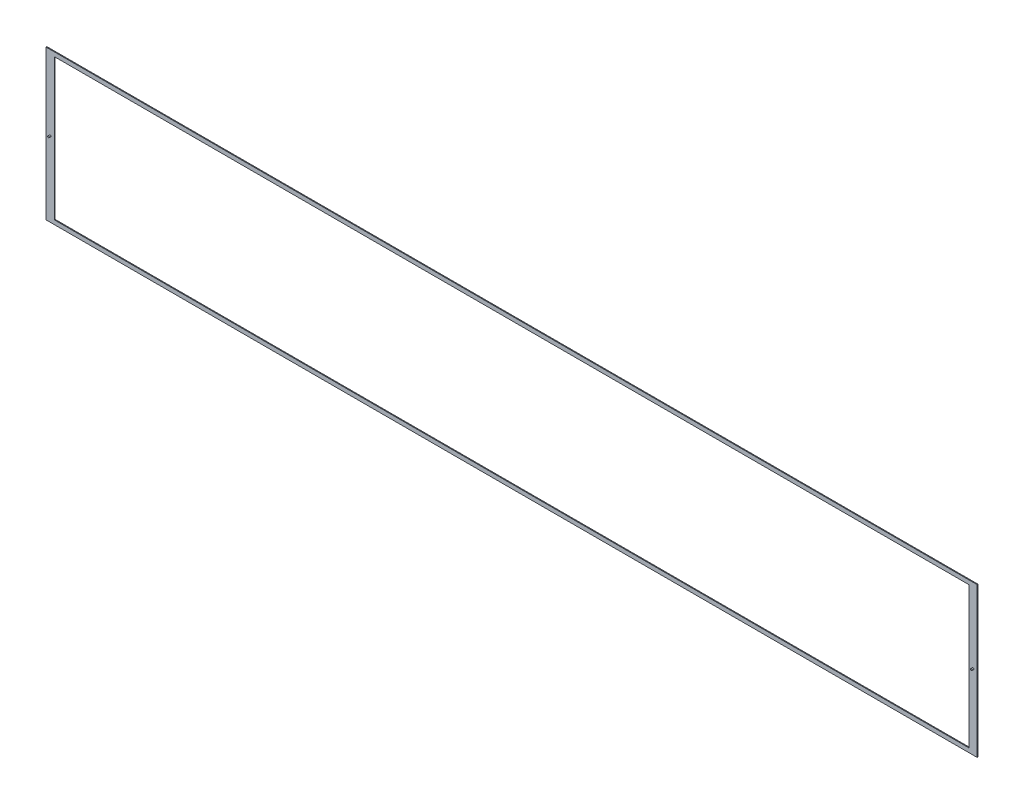
ISO-10303-21;
HEADER;
FILE_DESCRIPTION(('STEP AP214'),'2;1');
FILE_NAME('part.step','',(''),(''),'','','');
FILE_SCHEMA(('AUTOMOTIVE_DESIGN { 1 0 10303 214 1 1 1 1 }'));
ENDSEC;
DATA;
#1=APPLICATION_CONTEXT('core data for automotive mechanical design processes');
#2=APPLICATION_PROTOCOL_DEFINITION('international standard','automotive_design',2000,#1);
#3=PRODUCT_CONTEXT('',#1,'mechanical');
#4=PRODUCT('Part','Part','',(#3));
#5=PRODUCT_RELATED_PRODUCT_CATEGORY('part','',(#4));
#6=PRODUCT_DEFINITION_FORMATION('','',#4);
#7=PRODUCT_DEFINITION_CONTEXT('part definition',#1,'design');
#8=PRODUCT_DEFINITION('design','',#6,#7);
#9=PRODUCT_DEFINITION_SHAPE('','',#8);
#10=(LENGTH_UNIT() NAMED_UNIT(*) SI_UNIT(.MILLI.,.METRE.));
#11=(NAMED_UNIT(*) PLANE_ANGLE_UNIT() SI_UNIT($,.RADIAN.));
#12=(NAMED_UNIT(*) SI_UNIT($,.STERADIAN.) SOLID_ANGLE_UNIT());
#13=UNCERTAINTY_MEASURE_WITH_UNIT(LENGTH_MEASURE(1.E-05),#10,'distance_accuracy_value','');
#14=(GEOMETRIC_REPRESENTATION_CONTEXT(3) GLOBAL_UNCERTAINTY_ASSIGNED_CONTEXT((#13)) GLOBAL_UNIT_ASSIGNED_CONTEXT((#10,
#11,#12)) REPRESENTATION_CONTEXT('',''));
#15=CARTESIAN_POINT('',(0.,0.,0.));
#16=DIRECTION('',(0.,0.,1.));
#17=DIRECTION('',(1.,0.,0.));
#18=AXIS2_PLACEMENT_3D('',#15,#16,#17);
#19=CARTESIAN_POINT('',(-560.,-90.,1.));
#20=DIRECTION('',(-1.,0.,0.));
#21=DIRECTION('',(0.,0.,1.));
#22=AXIS2_PLACEMENT_3D('',#19,#20,#21);
#23=PLANE('',#22);
#24=DIRECTION('',(0.,1.,0.));
#25=VECTOR('',#24,1.);
#26=CARTESIAN_POINT('',(-560.,-90.,0.));
#27=LINE('',#26,#25);
#28=CARTESIAN_POINT('',(-560.,-90.,0.));
#29=VERTEX_POINT('',#28);
#30=CARTESIAN_POINT('',(-560.,90.,0.));
#31=VERTEX_POINT('',#30);
#32=EDGE_CURVE('E172',#29,#31,#27,.T.);
#33=ORIENTED_EDGE('',*,*,#32,.F.);
#34=DIRECTION('',(0.,0.,-1.));
#35=VECTOR('',#34,1.);
#36=CARTESIAN_POINT('',(-560.,-90.,1.));
#37=LINE('',#36,#35);
#38=CARTESIAN_POINT('',(-560.,-90.,1.));
#39=VERTEX_POINT('',#38);
#40=EDGE_CURVE('E71',#39,#29,#37,.T.);
#41=ORIENTED_EDGE('',*,*,#40,.F.);
#42=DIRECTION('',(0.,1.,0.));
#43=VECTOR('',#42,1.);
#44=CARTESIAN_POINT('',(-560.,-90.,1.));
#45=LINE('',#44,#43);
#46=CARTESIAN_POINT('',(-560.,90.,1.));
#47=VERTEX_POINT('',#46);
#48=EDGE_CURVE('E178',#39,#47,#45,.T.);
#49=ORIENTED_EDGE('',*,*,#48,.T.);
#50=DIRECTION('',(0.,0.,-1.));
#51=VECTOR('',#50,1.);
#52=CARTESIAN_POINT('',(-560.,90.,1.));
#53=LINE('',#52,#51);
#54=EDGE_CURVE('E193',#47,#31,#53,.T.);
#55=ORIENTED_EDGE('',*,*,#54,.T.);
#56=EDGE_LOOP('',(#33,#41,#49,#55));
#57=FACE_BOUND('',#56,.T.);
#58=ADVANCED_FACE('F63',(#57),#23,.T.);
#59=CARTESIAN_POINT('',(-560.,-90.,1.));
#60=DIRECTION('',(0.,1.,0.));
#61=DIRECTION('',(0.,0.,1.));
#62=AXIS2_PLACEMENT_3D('',#59,#60,#61);
#63=PLANE('',#62);
#64=DIRECTION('',(1.,0.,0.));
#65=VECTOR('',#64,1.);
#66=CARTESIAN_POINT('',(-560.,-90.,0.));
#67=LINE('',#66,#65);
#68=CARTESIAN_POINT('',(560.,-90.,0.));
#69=VERTEX_POINT('',#68);
#70=EDGE_CURVE('E183',#29,#69,#67,.T.);
#71=ORIENTED_EDGE('',*,*,#70,.T.);
#72=DIRECTION('',(0.,0.,-1.));
#73=VECTOR('',#72,1.);
#74=CARTESIAN_POINT('',(560.,-90.,1.));
#75=LINE('',#74,#73);
#76=CARTESIAN_POINT('',(560.,-90.,1.));
#77=VERTEX_POINT('',#76);
#78=EDGE_CURVE('E209',#77,#69,#75,.T.);
#79=ORIENTED_EDGE('',*,*,#78,.F.);
#80=DIRECTION('',(1.,0.,0.));
#81=VECTOR('',#80,1.);
#82=CARTESIAN_POINT('',(-560.,-90.,1.));
#83=LINE('',#82,#81);
#84=EDGE_CURVE('E190',#39,#77,#83,.T.);
#85=ORIENTED_EDGE('',*,*,#84,.F.);
#86=ORIENTED_EDGE('',*,*,#40,.T.);
#87=EDGE_LOOP('',(#71,#79,#85,#86));
#88=FACE_BOUND('',#87,.T.);
#89=ADVANCED_FACE('F230',(#88),#63,.F.);
#90=CARTESIAN_POINT('',(560.,-90.,1.));
#91=DIRECTION('',(-1.,0.,0.));
#92=DIRECTION('',(0.,0.,1.));
#93=AXIS2_PLACEMENT_3D('',#90,#91,#92);
#94=PLANE('',#93);
#95=DIRECTION('',(0.,1.,0.));
#96=VECTOR('',#95,1.);
#97=CARTESIAN_POINT('',(560.,-90.,0.));
#98=LINE('',#97,#96);
#99=CARTESIAN_POINT('',(560.,90.,0.));
#100=VERTEX_POINT('',#99);
#101=EDGE_CURVE('E201',#69,#100,#98,.T.);
#102=ORIENTED_EDGE('',*,*,#101,.T.);
#103=DIRECTION('',(0.,0.,-1.));
#104=VECTOR('',#103,1.);
#105=CARTESIAN_POINT('',(560.,90.,1.));
#106=LINE('',#105,#104);
#107=CARTESIAN_POINT('',(560.,90.,1.));
#108=VERTEX_POINT('',#107);
#109=EDGE_CURVE('E213',#108,#100,#106,.T.);
#110=ORIENTED_EDGE('',*,*,#109,.F.);
#111=DIRECTION('',(0.,1.,0.));
#112=VECTOR('',#111,1.);
#113=CARTESIAN_POINT('',(560.,-90.,1.));
#114=LINE('',#113,#112);
#115=EDGE_CURVE('E187',#77,#108,#114,.T.);
#116=ORIENTED_EDGE('',*,*,#115,.F.);
#117=ORIENTED_EDGE('',*,*,#78,.T.);
#118=EDGE_LOOP('',(#102,#110,#116,#117));
#119=FACE_BOUND('',#118,.T.);
#120=ADVANCED_FACE('F234',(#119),#94,.F.);
#121=CARTESIAN_POINT('',(-560.,90.,1.));
#122=DIRECTION('',(0.,1.,0.));
#123=DIRECTION('',(0.,0.,1.));
#124=AXIS2_PLACEMENT_3D('',#121,#122,#123);
#125=PLANE('',#124);
#126=DIRECTION('',(1.,0.,0.));
#127=VECTOR('',#126,1.);
#128=CARTESIAN_POINT('',(-560.,90.,0.));
#129=LINE('',#128,#127);
#130=EDGE_CURVE('E197',#31,#100,#129,.T.);
#131=ORIENTED_EDGE('',*,*,#130,.F.);
#132=ORIENTED_EDGE('',*,*,#54,.F.);
#133=DIRECTION('',(1.,0.,0.));
#134=VECTOR('',#133,1.);
#135=CARTESIAN_POINT('',(-560.,90.,1.));
#136=LINE('',#135,#134);
#137=EDGE_CURVE('E182',#47,#108,#136,.T.);
#138=ORIENTED_EDGE('',*,*,#137,.T.);
#139=ORIENTED_EDGE('',*,*,#109,.T.);
#140=EDGE_LOOP('',(#131,#132,#138,#139));
#141=FACE_BOUND('',#140,.T.);
#142=ADVANCED_FACE('F222',(#141),#125,.T.);
#143=CARTESIAN_POINT('',(0.,0.,1.));
#144=DIRECTION('',(0.,0.,-1.));
#145=DIRECTION('',(-1.,0.,0.));
#146=AXIS2_PLACEMENT_3D('',#143,#144,#145);
#147=PLANE('',#146);
#148=CARTESIAN_POINT('',(555.,0.,1.));
#149=DIRECTION('',(0.,0.,-1.));
#150=DIRECTION('',(-1.,0.,0.));
#151=AXIS2_PLACEMENT_3D('',#148,#149,#150);
#152=CIRCLE('',#151,1.00000000000005);
#153=CARTESIAN_POINT('',(554.,0.,1.));
#154=VERTEX_POINT('',#153);
#155=EDGE_CURVE('E355',#154,#154,#152,.T.);
#156=ORIENTED_EDGE('',*,*,#155,.T.);
#157=EDGE_LOOP('',(#156));
#158=FACE_BOUND('',#157,.T.);
#159=CARTESIAN_POINT('',(-555.,0.,1.));
#160=DIRECTION('',(0.,0.,-1.));
#161=DIRECTION('',(-1.,0.,0.));
#162=AXIS2_PLACEMENT_3D('',#159,#160,#161);
#163=CIRCLE('',#162,1.00000000000005);
#164=CARTESIAN_POINT('',(-556.,0.,1.));
#165=VERTEX_POINT('',#164);
#166=EDGE_CURVE('E12',#165,#165,#163,.F.);
#167=ORIENTED_EDGE('',*,*,#166,.F.);
#168=EDGE_LOOP('',(#167));
#169=FACE_BOUND('',#168,.T.);
#170=DIRECTION('',(1.,0.,0.));
#171=VECTOR('',#170,1.);
#172=CARTESIAN_POINT('',(-550.,-85.,1.));
#173=LINE('',#172,#171);
#174=CARTESIAN_POINT('',(-550.,-85.,1.));
#175=VERTEX_POINT('',#174);
#176=CARTESIAN_POINT('',(550.,-85.,1.));
#177=VERTEX_POINT('',#176);
#178=EDGE_CURVE('E134',#175,#177,#173,.T.);
#179=ORIENTED_EDGE('',*,*,#178,.F.);
#180=DIRECTION('',(0.,1.,0.));
#181=VECTOR('',#180,1.);
#182=CARTESIAN_POINT('',(-550.,-85.,1.));
#183=LINE('',#182,#181);
#184=CARTESIAN_POINT('',(-550.,85.0000000000001,1.));
#185=VERTEX_POINT('',#184);
#186=EDGE_CURVE('E130',#175,#185,#183,.T.);
#187=ORIENTED_EDGE('',*,*,#186,.T.);
#188=DIRECTION('',(1.,0.,0.));
#189=VECTOR('',#188,1.);
#190=CARTESIAN_POINT('',(-550.,85.0000000000001,1.));
#191=LINE('',#190,#189);
#192=CARTESIAN_POINT('',(550.,85.0000000000001,1.));
#193=VERTEX_POINT('',#192);
#194=EDGE_CURVE('E137',#185,#193,#191,.T.);
#195=ORIENTED_EDGE('',*,*,#194,.T.);
#196=DIRECTION('',(0.,1.,0.));
#197=VECTOR('',#196,1.);
#198=CARTESIAN_POINT('',(550.,-85.,1.));
#199=LINE('',#198,#197);
#200=EDGE_CURVE('E142',#177,#193,#199,.T.);
#201=ORIENTED_EDGE('',*,*,#200,.F.);
#202=EDGE_LOOP('',(#179,#187,#195,#201));
#203=FACE_BOUND('',#202,.T.);
#204=ORIENTED_EDGE('',*,*,#48,.F.);
#205=ORIENTED_EDGE('',*,*,#84,.T.);
#206=ORIENTED_EDGE('',*,*,#115,.T.);
#207=ORIENTED_EDGE('',*,*,#137,.F.);
#208=EDGE_LOOP('',(#204,#205,#206,#207));
#209=FACE_BOUND('',#208,.T.);
#210=ADVANCED_FACE('F144',(#158,#169,#203,#209),#147,.F.);
#211=CARTESIAN_POINT('',(0.,0.,0.));
#212=DIRECTION('',(0.,0.,-1.));
#213=DIRECTION('',(-1.,0.,0.));
#214=AXIS2_PLACEMENT_3D('',#211,#212,#213);
#215=PLANE('',#214);
#216=DIRECTION('',(0.,1.,0.));
#217=VECTOR('',#216,1.);
#218=CARTESIAN_POINT('',(-550.,-85.,0.));
#219=LINE('',#218,#217);
#220=CARTESIAN_POINT('',(-550.,-85.,0.));
#221=VERTEX_POINT('',#220);
#222=CARTESIAN_POINT('',(-550.,85.0000000000001,0.));
#223=VERTEX_POINT('',#222);
#224=EDGE_CURVE('E86',#221,#223,#219,.T.);
#225=ORIENTED_EDGE('',*,*,#224,.F.);
#226=DIRECTION('',(1.,0.,0.));
#227=VECTOR('',#226,1.);
#228=CARTESIAN_POINT('',(-550.,-85.,0.));
#229=LINE('',#228,#227);
#230=CARTESIAN_POINT('',(550.,-85.,0.));
#231=VERTEX_POINT('',#230);
#232=EDGE_CURVE('E147',#221,#231,#229,.T.);
#233=ORIENTED_EDGE('',*,*,#232,.T.);
#234=DIRECTION('',(0.,1.,0.));
#235=VECTOR('',#234,1.);
#236=CARTESIAN_POINT('',(550.,-85.,0.));
#237=LINE('',#236,#235);
#238=CARTESIAN_POINT('',(550.,85.0000000000001,0.));
#239=VERTEX_POINT('',#238);
#240=EDGE_CURVE('E151',#231,#239,#237,.T.);
#241=ORIENTED_EDGE('',*,*,#240,.T.);
#242=DIRECTION('',(1.,0.,0.));
#243=VECTOR('',#242,1.);
#244=CARTESIAN_POINT('',(-550.,85.0000000000001,0.));
#245=LINE('',#244,#243);
#246=EDGE_CURVE('E163',#223,#239,#245,.T.);
#247=ORIENTED_EDGE('',*,*,#246,.F.);
#248=EDGE_LOOP('',(#225,#233,#241,#247));
#249=FACE_BOUND('',#248,.T.);
#250=ORIENTED_EDGE('',*,*,#32,.T.);
#251=ORIENTED_EDGE('',*,*,#130,.T.);
#252=ORIENTED_EDGE('',*,*,#101,.F.);
#253=ORIENTED_EDGE('',*,*,#70,.F.);
#254=EDGE_LOOP('',(#250,#251,#252,#253));
#255=FACE_BOUND('',#254,.T.);
#256=ADVANCED_FACE('F227',(#249,#255),#215,.T.);
#257=CARTESIAN_POINT('',(-550.,-85.,1.));
#258=DIRECTION('',(-1.,0.,0.));
#259=DIRECTION('',(0.,0.,1.));
#260=AXIS2_PLACEMENT_3D('',#257,#258,#259);
#261=PLANE('',#260);
#262=ORIENTED_EDGE('',*,*,#224,.T.);
#263=DIRECTION('',(0.,0.,-1.));
#264=VECTOR('',#263,1.);
#265=CARTESIAN_POINT('',(-550.,85.0000000000001,1.));
#266=LINE('',#265,#264);
#267=EDGE_CURVE('E127',#185,#223,#266,.T.);
#268=ORIENTED_EDGE('',*,*,#267,.F.);
#269=ORIENTED_EDGE('',*,*,#186,.F.);
#270=DIRECTION('',(0.,0.,-1.));
#271=VECTOR('',#270,1.);
#272=CARTESIAN_POINT('',(-550.,-85.,1.));
#273=LINE('',#272,#271);
#274=EDGE_CURVE('E169',#175,#221,#273,.T.);
#275=ORIENTED_EDGE('',*,*,#274,.T.);
#276=EDGE_LOOP('',(#262,#268,#269,#275));
#277=FACE_BOUND('',#276,.T.);
#278=ADVANCED_FACE('F128',(#277),#261,.F.);
#279=CARTESIAN_POINT('',(-550.,-85.,1.));
#280=DIRECTION('',(0.,1.,0.));
#281=DIRECTION('',(0.,0.,1.));
#282=AXIS2_PLACEMENT_3D('',#279,#280,#281);
#283=PLANE('',#282);
#284=ORIENTED_EDGE('',*,*,#232,.F.);
#285=ORIENTED_EDGE('',*,*,#274,.F.);
#286=ORIENTED_EDGE('',*,*,#178,.T.);
#287=DIRECTION('',(0.,0.,-1.));
#288=VECTOR('',#287,1.);
#289=CARTESIAN_POINT('',(550.,-85.,1.));
#290=LINE('',#289,#288);
#291=EDGE_CURVE('E173',#177,#231,#290,.T.);
#292=ORIENTED_EDGE('',*,*,#291,.T.);
#293=EDGE_LOOP('',(#284,#285,#286,#292));
#294=FACE_BOUND('',#293,.T.);
#295=ADVANCED_FACE('F278',(#294),#283,.T.);
#296=CARTESIAN_POINT('',(550.,-85.,1.));
#297=DIRECTION('',(-1.,0.,0.));
#298=DIRECTION('',(0.,0.,1.));
#299=AXIS2_PLACEMENT_3D('',#296,#297,#298);
#300=PLANE('',#299);
#301=ORIENTED_EDGE('',*,*,#240,.F.);
#302=ORIENTED_EDGE('',*,*,#291,.F.);
#303=ORIENTED_EDGE('',*,*,#200,.T.);
#304=DIRECTION('',(0.,0.,-1.));
#305=VECTOR('',#304,1.);
#306=CARTESIAN_POINT('',(550.,85.0000000000001,1.));
#307=LINE('',#306,#305);
#308=EDGE_CURVE('E78',#193,#239,#307,.T.);
#309=ORIENTED_EDGE('',*,*,#308,.T.);
#310=EDGE_LOOP('',(#301,#302,#303,#309));
#311=FACE_BOUND('',#310,.T.);
#312=ADVANCED_FACE('F286',(#311),#300,.T.);
#313=CARTESIAN_POINT('',(-550.,85.0000000000001,1.));
#314=DIRECTION('',(0.,1.,0.));
#315=DIRECTION('',(0.,0.,1.));
#316=AXIS2_PLACEMENT_3D('',#313,#314,#315);
#317=PLANE('',#316);
#318=ORIENTED_EDGE('',*,*,#246,.T.);
#319=ORIENTED_EDGE('',*,*,#308,.F.);
#320=ORIENTED_EDGE('',*,*,#194,.F.);
#321=ORIENTED_EDGE('',*,*,#267,.T.);
#322=EDGE_LOOP('',(#318,#319,#320,#321));
#323=FACE_BOUND('',#322,.T.);
#324=ADVANCED_FACE('F138',(#323),#317,.F.);
#325=CARTESIAN_POINT('',(-555.,0.,3.));
#326=DIRECTION('',(0.,0.,-1.));
#327=DIRECTION('',(-1.,0.,0.));
#328=AXIS2_PLACEMENT_3D('',#325,#326,#327);
#329=CYLINDRICAL_SURFACE('',#328,1.00000000000005);
#330=CARTESIAN_POINT('',(-555.,0.,3.));
#331=DIRECTION('',(0.,0.,1.));
#332=DIRECTION('',(1.,0.,0.));
#333=AXIS2_PLACEMENT_3D('',#330,#331,#332);
#334=CIRCLE('',#333,1.00000000000005);
#335=CARTESIAN_POINT('',(-554.,0.,3.));
#336=VERTEX_POINT('',#335);
#337=EDGE_CURVE('E154',#336,#336,#334,.T.);
#338=ORIENTED_EDGE('',*,*,#337,.F.);
#339=EDGE_LOOP('',(#338));
#340=FACE_BOUND('',#339,.T.);
#341=ORIENTED_EDGE('',*,*,#166,.T.);
#342=EDGE_LOOP('',(#341));
#343=FACE_BOUND('',#342,.T.);
#344=ADVANCED_FACE('F305',(#340,#343),#329,.T.);
#345=CARTESIAN_POINT('',(-555.,0.,3.));
#346=DIRECTION('',(0.,0.,1.));
#347=DIRECTION('',(1.,0.,0.));
#348=AXIS2_PLACEMENT_3D('',#345,#346,#347);
#349=PLANE('',#348);
#350=ORIENTED_EDGE('',*,*,#337,.T.);
#351=EDGE_LOOP('',(#350));
#352=FACE_BOUND('',#351,.T.);
#353=ADVANCED_FACE('F314',(#352),#349,.T.);
#354=CARTESIAN_POINT('',(555.,0.,3.));
#355=DIRECTION('',(0.,0.,-1.));
#356=DIRECTION('',(-1.,0.,0.));
#357=AXIS2_PLACEMENT_3D('',#354,#355,#356);
#358=CYLINDRICAL_SURFACE('',#357,1.00000000000005);
#359=CARTESIAN_POINT('',(555.,0.,3.));
#360=DIRECTION('',(0.,0.,-1.));
#361=DIRECTION('',(-1.,0.,0.));
#362=AXIS2_PLACEMENT_3D('',#359,#360,#361);
#363=CIRCLE('',#362,1.00000000000005);
#364=CARTESIAN_POINT('',(554.,0.,3.));
#365=VERTEX_POINT('',#364);
#366=EDGE_CURVE('E353',#365,#365,#363,.T.);
#367=ORIENTED_EDGE('',*,*,#366,.T.);
#368=EDGE_LOOP('',(#367));
#369=FACE_BOUND('',#368,.T.);
#370=ORIENTED_EDGE('',*,*,#155,.F.);
#371=EDGE_LOOP('',(#370));
#372=FACE_BOUND('',#371,.T.);
#373=ADVANCED_FACE('F323',(#369,#372),#358,.T.);
#374=CARTESIAN_POINT('',(555.,0.,3.));
#375=DIRECTION('',(0.,0.,1.));
#376=DIRECTION('',(-1.,0.,0.));
#377=AXIS2_PLACEMENT_3D('',#374,#375,#376);
#378=PLANE('',#377);
#379=ORIENTED_EDGE('',*,*,#366,.F.);
#380=EDGE_LOOP('',(#379));
#381=FACE_BOUND('',#380,.T.);
#382=ADVANCED_FACE('F337',(#381),#378,.T.);
#383=CLOSED_SHELL('',(#58,#89,#120,#142,#210,#256,#278,#295,#312,#324,#344,#353,#373,#382));
#384=MANIFOLD_SOLID_BREP('B2',#383);
#385=ADVANCED_BREP_SHAPE_REPRESENTATION('',(#18,#384),#14);
#386=SHAPE_DEFINITION_REPRESENTATION(#9,#385);
ENDSEC;
END-ISO-10303-21;
